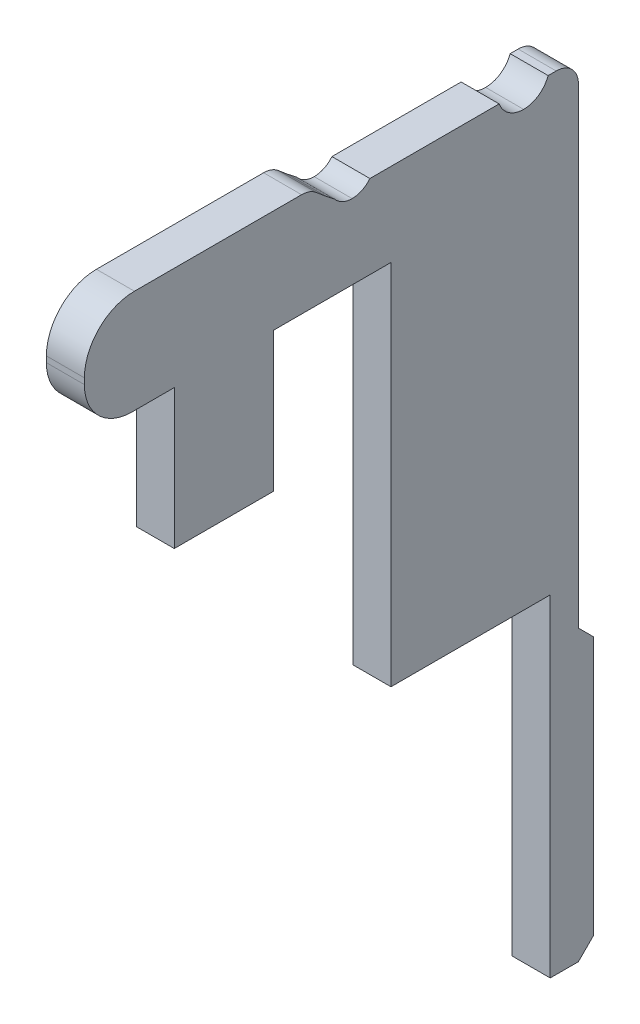
ISO-10303-21;
HEADER;
FILE_DESCRIPTION(('STEP AP214'),'2;1');
FILE_NAME('part.step','',(''),(''),'','','');
FILE_SCHEMA(('AUTOMOTIVE_DESIGN { 1 0 10303 214 1 1 1 1 }'));
ENDSEC;
DATA;
#1=APPLICATION_CONTEXT('core data for automotive mechanical design processes');
#2=APPLICATION_PROTOCOL_DEFINITION('international standard','automotive_design',2000,#1);
#3=PRODUCT_CONTEXT('',#1,'mechanical');
#4=PRODUCT('Part','Part','',(#3));
#5=PRODUCT_RELATED_PRODUCT_CATEGORY('part','',(#4));
#6=PRODUCT_DEFINITION_FORMATION('','',#4);
#7=PRODUCT_DEFINITION_CONTEXT('part definition',#1,'design');
#8=PRODUCT_DEFINITION('design','',#6,#7);
#9=PRODUCT_DEFINITION_SHAPE('','',#8);
#10=(LENGTH_UNIT() NAMED_UNIT(*) SI_UNIT(.MILLI.,.METRE.));
#11=(NAMED_UNIT(*) PLANE_ANGLE_UNIT() SI_UNIT($,.RADIAN.));
#12=(NAMED_UNIT(*) SI_UNIT($,.STERADIAN.) SOLID_ANGLE_UNIT());
#13=UNCERTAINTY_MEASURE_WITH_UNIT(LENGTH_MEASURE(1.E-05),#10,'distance_accuracy_value','');
#14=(GEOMETRIC_REPRESENTATION_CONTEXT(3) GLOBAL_UNCERTAINTY_ASSIGNED_CONTEXT((#13)) GLOBAL_UNIT_ASSIGNED_CONTEXT((#10,
#11,#12)) REPRESENTATION_CONTEXT('',''));
#15=CARTESIAN_POINT('',(0.,0.,0.));
#16=DIRECTION('',(0.,0.,1.));
#17=DIRECTION('',(1.,0.,0.));
#18=AXIS2_PLACEMENT_3D('',#15,#16,#17);
#19=CARTESIAN_POINT('',(3.791025966667,-11.01654617923,3.239858541256));
#20=DIRECTION('',(-1.,0.,0.));
#21=DIRECTION('',(0.,0.,1.));
#22=AXIS2_PLACEMENT_3D('',#19,#20,#21);
#23=PLANE('',#22);
#24=DIRECTION('',(0.,-1.,0.));
#25=VECTOR('',#24,1.);
#26=CARTESIAN_POINT('',(3.791025966667,-11.56808151461,1.690040249312));
#27=LINE('',#26,#25);
#28=CARTESIAN_POINT('',(3.791025966667,-11.56808151461,1.690040249312));
#29=VERTEX_POINT('',#28);
#30=CARTESIAN_POINT('',(3.791025966667,-12.92902195149,1.690040249312));
#31=VERTEX_POINT('',#30);
#32=EDGE_CURVE('E11',#29,#31,#27,.T.);
#33=ORIENTED_EDGE('',*,*,#32,.F.);
#34=DIRECTION('',(0.,0.707106781186548,0.707106781186548));
#35=VECTOR('',#34,1.);
#36=CARTESIAN_POINT('',(3.791025966667,-11.56808151461,1.690040249312));
#37=LINE('',#36,#35);
#38=CARTESIAN_POINT('',(3.791025966667,-11.48809089309,1.770030870831));
#39=VERTEX_POINT('',#38);
#40=EDGE_CURVE('E25',#29,#39,#37,.T.);
#41=ORIENTED_EDGE('',*,*,#40,.T.);
#42=DIRECTION('',(0.,-1.,0.));
#43=VECTOR('',#42,1.);
#44=CARTESIAN_POINT('',(3.791025966667,-9.007381743218,1.770030870831));
#45=LINE('',#44,#43);
#46=CARTESIAN_POINT('',(3.791025966667,-9.007381743218,1.770030870831));
#47=VERTEX_POINT('',#46);
#48=EDGE_CURVE('E470',#47,#39,#45,.T.);
#49=ORIENTED_EDGE('',*,*,#48,.F.);
#50=CARTESIAN_POINT('',(3.791025966667,-9.007381743218,1.887017154804));
#51=DIRECTION('',(-1.,0.,0.));
#52=DIRECTION('',(0.,1.,0.));
#53=AXIS2_PLACEMENT_3D('',#50,#51,#52);
#54=CIRCLE('',#53,0.116986283973);
#55=CARTESIAN_POINT('',(3.791025966667,-8.890395459246,1.887017154804));
#56=VERTEX_POINT('',#55);
#57=EDGE_CURVE('E465',#56,#47,#54,.T.);
#58=ORIENTED_EDGE('',*,*,#57,.F.);
#59=DIRECTION('',(0.,0.,-1.));
#60=VECTOR('',#59,1.);
#61=CARTESIAN_POINT('',(3.791025966667,-8.890395459246,1.929141929951));
#62=LINE('',#61,#60);
#63=CARTESIAN_POINT('',(3.791025966667,-8.890395459246,1.929141929951));
#64=VERTEX_POINT('',#63);
#65=EDGE_CURVE('E461',#64,#56,#62,.T.);
#66=ORIENTED_EDGE('',*,*,#65,.F.);
#67=CARTESIAN_POINT('',(3.791025966667,-8.842101121503,2.058184733088));
#68=DIRECTION('',(1.,0.,0.));
#69=DIRECTION('',(0.,-0.350507982583099,0.936559744034264));
#70=AXIS2_PLACEMENT_3D('',#67,#68,#69);
#71=CIRCLE('',#70,0.137783845568);
#72=CARTESIAN_POINT('',(3.791025966667,-8.979884967071,2.058184733088));
#73=VERTEX_POINT('',#72);
#74=EDGE_CURVE('E209',#73,#64,#71,.T.);
#75=ORIENTED_EDGE('',*,*,#74,.F.);
#76=CARTESIAN_POINT('',(3.791025966667,-8.842101121503,2.058184733088));
#77=DIRECTION('',(1.,0.,0.));
#78=DIRECTION('',(0.,-0.350507982583099,0.936559744034264));
#79=AXIS2_PLACEMENT_3D('',#76,#77,#78);
#80=CIRCLE('',#79,0.137783845568);
#81=CARTESIAN_POINT('',(3.791025966667,-8.890395459246,2.187227536225));
#82=VERTEX_POINT('',#81);
#83=EDGE_CURVE('E453',#82,#73,#80,.T.);
#84=ORIENTED_EDGE('',*,*,#83,.F.);
#85=DIRECTION('',(0.,0.,-1.));
#86=VECTOR('',#85,1.);
#87=CARTESIAN_POINT('',(3.791025966667,-8.890395459246,2.867347795696));
#88=LINE('',#87,#86);
#89=CARTESIAN_POINT('',(3.791025966667,-8.890395459246,2.867347795696));
#90=VERTEX_POINT('',#89);
#91=EDGE_CURVE('E448',#90,#82,#88,.T.);
#92=ORIENTED_EDGE('',*,*,#91,.F.);
#93=CARTESIAN_POINT('',(3.791025966667,-8.815690770428,2.960728820981));
#94=DIRECTION('',(1.,0.,0.));
#95=DIRECTION('',(0.,-0.624694377505048,0.78086934548206));
#96=AXIS2_PLACEMENT_3D('',#93,#94,#95);
#97=CIRCLE('',#96,0.119585979172);
#98=CARTESIAN_POINT('',(3.791025966667,-8.9352767496,2.960728820981));
#99=VERTEX_POINT('',#98);
#100=EDGE_CURVE('E443',#99,#90,#97,.T.);
#101=ORIENTED_EDGE('',*,*,#100,.F.);
#102=CARTESIAN_POINT('',(3.791025966667,-8.815690770428,2.960728820981));
#103=DIRECTION('',(1.,0.,0.));
#104=DIRECTION('',(0.,-0.624694377505048,0.78086934548206));
#105=AXIS2_PLACEMENT_3D('',#102,#103,#104);
#106=CIRCLE('',#105,0.119585979172);
#107=CARTESIAN_POINT('',(3.791025966667,-8.890395459246,3.054109846266));
#108=VERTEX_POINT('',#107);
#109=EDGE_CURVE('E438',#108,#99,#106,.T.);
#110=ORIENTED_EDGE('',*,*,#109,.F.);
#111=DIRECTION('',(0.,-0.614333401356799,-0.789046558814742));
#112=VECTOR('',#111,1.);
#113=CARTESIAN_POINT('',(3.791025966667,-8.855429561475,3.099019859706));
#114=LINE('',#113,#112);
#115=CARTESIAN_POINT('',(3.791025966667,-8.855429561475,3.099019859706));
#116=VERTEX_POINT('',#115);
#117=EDGE_CURVE('E433',#116,#108,#114,.T.);
#118=ORIENTED_EDGE('',*,*,#117,.F.);
#119=DIRECTION('',(0.,-0.645196367154793,-0.764016785031755));
#120=VECTOR('',#119,1.);
#121=CARTESIAN_POINT('',(3.791025966667,-8.812628169562,3.149703625935));
#122=LINE('',#121,#120);
#123=CARTESIAN_POINT('',(3.791025966667,-8.812628169562,3.149703625935));
#124=VERTEX_POINT('',#123);
#125=EDGE_CURVE('E428',#124,#116,#122,.T.);
#126=ORIENTED_EDGE('',*,*,#125,.F.);
#127=CARTESIAN_POINT('',(3.791025966667,-8.903993864904,3.226860065259));
#128=DIRECTION('',(-1.,0.,0.));
#129=DIRECTION('',(0.,1.,0.));
#130=AXIS2_PLACEMENT_3D('',#127,#128,#129);
#131=CIRCLE('',#130,0.119585979172);
#132=CARTESIAN_POINT('',(3.791025966667,-8.784407885732,3.226860065259));
#133=VERTEX_POINT('',#132);
#134=EDGE_CURVE('E423',#133,#124,#131,.T.);
#135=ORIENTED_EDGE('',*,*,#134,.F.);
#136=DIRECTION('',(0.,0.,-1.));
#137=VECTOR('',#136,1.);
#138=CARTESIAN_POINT('',(3.791025966667,-8.784407885732,4.106656913699));
#139=LINE('',#138,#137);
#140=CARTESIAN_POINT('',(3.791025966667,-8.784407885732,4.106656913699));
#141=VERTEX_POINT('',#140);
#142=EDGE_CURVE('E418',#141,#133,#139,.T.);
#143=ORIENTED_EDGE('',*,*,#142,.F.);
#144=CARTESIAN_POINT('',(3.791025966667,-9.047677018809,4.106656913699));
#145=DIRECTION('',(-1.,0.,0.));
#146=DIRECTION('',(0.,0.,1.));
#147=AXIS2_PLACEMENT_3D('',#144,#145,#146);
#148=CIRCLE('',#147,0.263269133077);
#149=CARTESIAN_POINT('',(3.791025966667,-9.047677018809,4.369926046776));
#150=VERTEX_POINT('',#149);
#151=EDGE_CURVE('E413',#150,#141,#148,.T.);
#152=ORIENTED_EDGE('',*,*,#151,.F.);
#153=DIRECTION('',(0.,1.,0.));
#154=VECTOR('',#153,1.);
#155=CARTESIAN_POINT('',(3.791025966667,-9.078573396371,4.369926046776));
#156=LINE('',#155,#154);
#157=CARTESIAN_POINT('',(3.791025966667,-9.078573396371,4.369926046776));
#158=VERTEX_POINT('',#157);
#159=EDGE_CURVE('E408',#158,#150,#156,.T.);
#160=ORIENTED_EDGE('',*,*,#159,.F.);
#161=CARTESIAN_POINT('',(3.791025966667,-9.078573396371,4.119955354526));
#162=DIRECTION('',(-1.,0.,0.));
#163=DIRECTION('',(0.,-1.,0.));
#164=AXIS2_PLACEMENT_3D('',#161,#162,#163);
#165=CIRCLE('',#164,0.249970692249);
#166=CARTESIAN_POINT('',(3.791025966667,-9.32854408862,4.119955354526));
#167=VERTEX_POINT('',#166);
#168=EDGE_CURVE('E403',#167,#158,#165,.T.);
#169=ORIENTED_EDGE('',*,*,#168,.F.);
#170=DIRECTION('',(0.,0.,1.));
#171=VECTOR('',#170,1.);
#172=CARTESIAN_POINT('',(3.791025966667,-9.32854408862,3.896881508763));
#173=LINE('',#172,#171);
#174=CARTESIAN_POINT('',(3.791025966667,-9.32854408862,3.896881508763));
#175=VERTEX_POINT('',#174);
#176=EDGE_CURVE('E398',#175,#167,#173,.T.);
#177=ORIENTED_EDGE('',*,*,#176,.F.);
#178=DIRECTION('',(0.,1.,0.));
#179=VECTOR('',#178,1.);
#180=CARTESIAN_POINT('',(3.791025966667,-10.06235805278,3.896881508763));
#181=LINE('',#180,#179);
#182=CARTESIAN_POINT('',(3.791025966667,-10.06235805278,3.896881508763));
#183=VERTEX_POINT('',#182);
#184=EDGE_CURVE('E393',#183,#175,#181,.T.);
#185=ORIENTED_EDGE('',*,*,#184,.F.);
#186=DIRECTION('',(0.,0.,1.));
#187=VECTOR('',#186,1.);
#188=CARTESIAN_POINT('',(3.791025966667,-10.06235805278,3.375242668178));
#189=LINE('',#188,#187);
#190=CARTESIAN_POINT('',(3.791025966667,-10.06235805278,3.375242668178));
#191=VERTEX_POINT('',#190);
#192=EDGE_CURVE('E388',#191,#183,#189,.T.);
#193=ORIENTED_EDGE('',*,*,#192,.F.);
#194=DIRECTION('',(0.,-1.,0.));
#195=VECTOR('',#194,1.);
#196=CARTESIAN_POINT('',(3.791025966667,-9.32854408862,3.375242668178));
#197=LINE('',#196,#195);
#198=CARTESIAN_POINT('',(3.791025966667,-9.32854408862,3.375242668178));
#199=VERTEX_POINT('',#198);
#200=EDGE_CURVE('E383',#199,#191,#197,.T.);
#201=ORIENTED_EDGE('',*,*,#200,.F.);
#202=DIRECTION('',(0.,0.,1.));
#203=VECTOR('',#202,1.);
#204=CARTESIAN_POINT('',(3.791025966667,-9.32854408862,2.756415222446));
#205=LINE('',#204,#203);
#206=CARTESIAN_POINT('',(3.791025966667,-9.32854408862,2.756415222446));
#207=VERTEX_POINT('',#206);
#208=EDGE_CURVE('E378',#207,#199,#205,.T.);
#209=ORIENTED_EDGE('',*,*,#208,.F.);
#210=DIRECTION('',(0.,1.,0.));
#211=VECTOR('',#210,1.);
#212=CARTESIAN_POINT('',(3.791025966667,-11.26271731696,2.756415222446));
#213=LINE('',#212,#211);
#214=CARTESIAN_POINT('',(3.791025966667,-11.26271731696,2.756415222446));
#215=VERTEX_POINT('',#214);
#216=EDGE_CURVE('E373',#215,#207,#213,.T.);
#217=ORIENTED_EDGE('',*,*,#216,.F.);
#218=DIRECTION('',(0.,0.,1.));
#219=VECTOR('',#218,1.);
#220=CARTESIAN_POINT('',(3.791025966667,-11.26271731696,1.918313485474));
#221=LINE('',#220,#219);
#222=CARTESIAN_POINT('',(3.791025966667,-11.26271731696,1.918313485474));
#223=VERTEX_POINT('',#222);
#224=EDGE_CURVE('E368',#223,#215,#221,.T.);
#225=ORIENTED_EDGE('',*,*,#224,.F.);
#226=DIRECTION('',(0.,1.,0.));
#227=VECTOR('',#226,1.);
#228=CARTESIAN_POINT('',(3.791025966667,-13.00901257301,1.918313485474));
#229=LINE('',#228,#227);
#230=CARTESIAN_POINT('',(3.791025966667,-13.00901257301,1.918313485474));
#231=VERTEX_POINT('',#230);
#232=EDGE_CURVE('E363',#231,#223,#229,.T.);
#233=ORIENTED_EDGE('',*,*,#232,.F.);
#234=DIRECTION('',(0.,0.,1.));
#235=VECTOR('',#234,1.);
#236=CARTESIAN_POINT('',(3.791025966667,-13.00901257301,1.770030870831));
#237=LINE('',#236,#235);
#238=CARTESIAN_POINT('',(3.791025966667,-13.00901257301,1.770030870831));
#239=VERTEX_POINT('',#238);
#240=EDGE_CURVE('E358',#239,#231,#237,.T.);
#241=ORIENTED_EDGE('',*,*,#240,.F.);
#242=DIRECTION('',(0.,0.707106781186548,-0.707106781186548));
#243=VECTOR('',#242,1.);
#244=CARTESIAN_POINT('',(3.791025966667,-13.00901257301,1.770030870831));
#245=LINE('',#244,#243);
#246=EDGE_CURVE('E354',#239,#31,#245,.T.);
#247=ORIENTED_EDGE('',*,*,#246,.T.);
#248=EDGE_LOOP('',(#33,#41,#49,#58,#66,#75,#84,#92,#101,#110,#118,#126,#135,#143,#152,#160,#169,
#177,#185,#193,#201,#209,#217,#225,#233,#241,#247));
#249=FACE_BOUND('',#248,.T.);
#250=ADVANCED_FACE('F17',(#249),#23,.F.);
#251=CARTESIAN_POINT('',(3.691037689767,-12.96901726225,1.730035560072));
#252=DIRECTION('',(0.,-0.707106781186548,-0.707106781186548));
#253=DIRECTION('',(0.,-0.707106781186548,0.707106781186548));
#254=AXIS2_PLACEMENT_3D('',#251,#252,#253);
#255=PLANE('',#254);
#256=DIRECTION('',(1.,0.,0.));
#257=VECTOR('',#256,1.);
#258=CARTESIAN_POINT('',(3.591049412868,-13.00901257301,1.770030870831));
#259=LINE('',#258,#257);
#260=CARTESIAN_POINT('',(3.591049412868,-13.00901257301,1.770030870831));
#261=VERTEX_POINT('',#260);
#262=EDGE_CURVE('E349',#261,#239,#259,.T.);
#263=ORIENTED_EDGE('',*,*,#262,.F.);
#264=DIRECTION('',(0.,-0.707106781186548,0.707106781186548));
#265=VECTOR('',#264,1.);
#266=CARTESIAN_POINT('',(3.591049412868,-12.92902195149,1.690040249312));
#267=LINE('',#266,#265);
#268=CARTESIAN_POINT('',(3.591049412868,-12.92902195149,1.690040249312));
#269=VERTEX_POINT('',#268);
#270=EDGE_CURVE('E344',#269,#261,#267,.T.);
#271=ORIENTED_EDGE('',*,*,#270,.F.);
#272=DIRECTION('',(1.,0.,0.));
#273=VECTOR('',#272,1.);
#274=CARTESIAN_POINT('',(3.591049412868,-12.92902195149,1.690040249312));
#275=LINE('',#274,#273);
#276=EDGE_CURVE('E339',#269,#31,#275,.T.);
#277=ORIENTED_EDGE('',*,*,#276,.T.);
#278=ORIENTED_EDGE('',*,*,#246,.F.);
#279=EDGE_LOOP('',(#263,#271,#277,#278));
#280=FACE_BOUND('',#279,.T.);
#281=ADVANCED_FACE('F491',(#280),#255,.T.);
#282=CARTESIAN_POINT('',(3.591049412868,-11.56808151461,1.690040249312));
#283=DIRECTION('',(0.,0.,1.));
#284=DIRECTION('',(1.,0.,0.));
#285=AXIS2_PLACEMENT_3D('',#282,#283,#284);
#286=PLANE('',#285);
#287=DIRECTION('',(0.,-1.,0.));
#288=VECTOR('',#287,1.);
#289=CARTESIAN_POINT('',(3.591049412868,-11.56808151461,1.690040249312));
#290=LINE('',#289,#288);
#291=CARTESIAN_POINT('',(3.591049412868,-11.56808151461,1.690040249312));
#292=VERTEX_POINT('',#291);
#293=EDGE_CURVE('E334',#292,#269,#290,.T.);
#294=ORIENTED_EDGE('',*,*,#293,.F.);
#295=DIRECTION('',(-1.,0.,0.));
#296=VECTOR('',#295,1.);
#297=CARTESIAN_POINT('',(3.791025966667,-11.56808151461,1.690040249312));
#298=LINE('',#297,#296);
#299=EDGE_CURVE('E329',#29,#292,#298,.T.);
#300=ORIENTED_EDGE('',*,*,#299,.F.);
#301=ORIENTED_EDGE('',*,*,#32,.T.);
#302=ORIENTED_EDGE('',*,*,#276,.F.);
#303=EDGE_LOOP('',(#294,#300,#301,#302));
#304=FACE_BOUND('',#303,.T.);
#305=ADVANCED_FACE('F488',(#304),#286,.F.);
#306=CARTESIAN_POINT('',(3.691037689767,-11.52808620385,1.730035560072));
#307=DIRECTION('',(0.,0.707106781186548,-0.707106781186548));
#308=DIRECTION('',(-1.,0.,0.));
#309=AXIS2_PLACEMENT_3D('',#306,#307,#308);
#310=PLANE('',#309);
#311=DIRECTION('',(0.,-0.707106781186548,-0.707106781186548));
#312=VECTOR('',#311,1.);
#313=CARTESIAN_POINT('',(3.591049412868,-11.48809089309,1.770030870831));
#314=LINE('',#313,#312);
#315=CARTESIAN_POINT('',(3.591049412868,-11.48809089309,1.770030870831));
#316=VERTEX_POINT('',#315);
#317=EDGE_CURVE('E324',#316,#292,#314,.T.);
#318=ORIENTED_EDGE('',*,*,#317,.F.);
#319=DIRECTION('',(-1.,0.,0.));
#320=VECTOR('',#319,1.);
#321=CARTESIAN_POINT('',(3.791025966667,-11.48809089309,1.770030870831));
#322=LINE('',#321,#320);
#323=EDGE_CURVE('E319',#39,#316,#322,.T.);
#324=ORIENTED_EDGE('',*,*,#323,.F.);
#325=ORIENTED_EDGE('',*,*,#40,.F.);
#326=ORIENTED_EDGE('',*,*,#299,.T.);
#327=EDGE_LOOP('',(#318,#324,#325,#326));
#328=FACE_BOUND('',#327,.T.);
#329=ADVANCED_FACE('F486',(#328),#310,.T.);
#330=CARTESIAN_POINT('',(3.591049412868,-9.007381743218,1.770030870831));
#331=DIRECTION('',(0.,0.,1.));
#332=DIRECTION('',(1.,0.,0.));
#333=AXIS2_PLACEMENT_3D('',#330,#331,#332);
#334=PLANE('',#333);
#335=DIRECTION('',(0.,-1.,0.));
#336=VECTOR('',#335,1.);
#337=CARTESIAN_POINT('',(3.591049412868,-9.007381743218,1.770030870831));
#338=LINE('',#337,#336);
#339=CARTESIAN_POINT('',(3.591049412868,-9.007381743218,1.770030870831));
#340=VERTEX_POINT('',#339);
#341=EDGE_CURVE('E314',#340,#316,#338,.T.);
#342=ORIENTED_EDGE('',*,*,#341,.F.);
#343=DIRECTION('',(1.,0.,0.));
#344=VECTOR('',#343,1.);
#345=CARTESIAN_POINT('',(3.591049412868,-9.007381743218,1.770030870831));
#346=LINE('',#345,#344);
#347=EDGE_CURVE('E309',#340,#47,#346,.T.);
#348=ORIENTED_EDGE('',*,*,#347,.T.);
#349=ORIENTED_EDGE('',*,*,#48,.T.);
#350=ORIENTED_EDGE('',*,*,#323,.T.);
#351=EDGE_LOOP('',(#342,#348,#349,#350));
#352=FACE_BOUND('',#351,.T.);
#353=ADVANCED_FACE('F480',(#352),#334,.F.);
#354=CARTESIAN_POINT('',(3.591049412868,-9.007381743218,1.887017154804));
#355=DIRECTION('',(-1.,0.,0.));
#356=DIRECTION('',(0.,-0.707106781186549,0.707106781186546));
#357=AXIS2_PLACEMENT_3D('',#354,#355,#356);
#358=CYLINDRICAL_SURFACE('',#357,0.116986283973);
#359=DIRECTION('',(1.,0.,0.));
#360=VECTOR('',#359,1.);
#361=CARTESIAN_POINT('',(3.591049412868,-8.890395459246,1.887017154804));
#362=LINE('',#361,#360);
#363=CARTESIAN_POINT('',(3.591049412868,-8.890395459246,1.887017154804));
#364=VERTEX_POINT('',#363);
#365=EDGE_CURVE('E216',#364,#56,#362,.T.);
#366=ORIENTED_EDGE('',*,*,#365,.T.);
#367=ORIENTED_EDGE('',*,*,#57,.T.);
#368=ORIENTED_EDGE('',*,*,#347,.F.);
#369=CARTESIAN_POINT('',(3.591049412868,-9.007381743218,1.887017154804));
#370=DIRECTION('',(-1.,0.,0.));
#371=DIRECTION('',(0.,1.,0.));
#372=AXIS2_PLACEMENT_3D('',#369,#370,#371);
#373=CIRCLE('',#372,0.116986283973);
#374=EDGE_CURVE('E302',#364,#340,#373,.T.);
#375=ORIENTED_EDGE('',*,*,#374,.F.);
#376=EDGE_LOOP('',(#366,#367,#368,#375));
#377=FACE_BOUND('',#376,.T.);
#378=ADVANCED_FACE('F483',(#377),#358,.T.);
#379=CARTESIAN_POINT('',(3.591049412868,-11.01654617923,3.239858541256));
#380=DIRECTION('',(-1.,0.,0.));
#381=DIRECTION('',(0.,0.,1.));
#382=AXIS2_PLACEMENT_3D('',#379,#380,#381);
#383=PLANE('',#382);
#384=DIRECTION('',(0.,0.,1.));
#385=VECTOR('',#384,1.);
#386=CARTESIAN_POINT('',(3.591049412868,-13.00901257301,1.770030870831));
#387=LINE('',#386,#385);
#388=CARTESIAN_POINT('',(3.591049412868,-13.00901257301,1.918313485474));
#389=VERTEX_POINT('',#388);
#390=EDGE_CURVE('E298',#261,#389,#387,.T.);
#391=ORIENTED_EDGE('',*,*,#390,.T.);
#392=DIRECTION('',(0.,1.,0.));
#393=VECTOR('',#392,1.);
#394=CARTESIAN_POINT('',(3.591049412868,-13.00901257301,1.918313485474));
#395=LINE('',#394,#393);
#396=CARTESIAN_POINT('',(3.591049412868,-11.26271731696,1.918313485474));
#397=VERTEX_POINT('',#396);
#398=EDGE_CURVE('E294',#389,#397,#395,.T.);
#399=ORIENTED_EDGE('',*,*,#398,.T.);
#400=DIRECTION('',(0.,0.,1.));
#401=VECTOR('',#400,1.);
#402=CARTESIAN_POINT('',(3.591049412868,-11.26271731696,1.918313485474));
#403=LINE('',#402,#401);
#404=CARTESIAN_POINT('',(3.591049412868,-11.26271731696,2.756415222446));
#405=VERTEX_POINT('',#404);
#406=EDGE_CURVE('E290',#397,#405,#403,.T.);
#407=ORIENTED_EDGE('',*,*,#406,.T.);
#408=DIRECTION('',(0.,1.,0.));
#409=VECTOR('',#408,1.);
#410=CARTESIAN_POINT('',(3.591049412868,-11.26271731696,2.756415222446));
#411=LINE('',#410,#409);
#412=CARTESIAN_POINT('',(3.591049412868,-9.32854408862,2.756415222446));
#413=VERTEX_POINT('',#412);
#414=EDGE_CURVE('E286',#405,#413,#411,.T.);
#415=ORIENTED_EDGE('',*,*,#414,.T.);
#416=DIRECTION('',(0.,0.,1.));
#417=VECTOR('',#416,1.);
#418=CARTESIAN_POINT('',(3.591049412868,-9.32854408862,2.756415222446));
#419=LINE('',#418,#417);
#420=CARTESIAN_POINT('',(3.591049412868,-9.32854408862,3.375242668178));
#421=VERTEX_POINT('',#420);
#422=EDGE_CURVE('E282',#413,#421,#419,.T.);
#423=ORIENTED_EDGE('',*,*,#422,.T.);
#424=DIRECTION('',(0.,-1.,0.));
#425=VECTOR('',#424,1.);
#426=CARTESIAN_POINT('',(3.591049412868,-9.32854408862,3.375242668178));
#427=LINE('',#426,#425);
#428=CARTESIAN_POINT('',(3.591049412868,-10.06235805278,3.375242668178));
#429=VERTEX_POINT('',#428);
#430=EDGE_CURVE('E278',#421,#429,#427,.T.);
#431=ORIENTED_EDGE('',*,*,#430,.T.);
#432=DIRECTION('',(0.,0.,1.));
#433=VECTOR('',#432,1.);
#434=CARTESIAN_POINT('',(3.591049412868,-10.06235805278,3.375242668178));
#435=LINE('',#434,#433);
#436=CARTESIAN_POINT('',(3.591049412868,-10.06235805278,3.896881508763));
#437=VERTEX_POINT('',#436);
#438=EDGE_CURVE('E274',#429,#437,#435,.T.);
#439=ORIENTED_EDGE('',*,*,#438,.T.);
#440=DIRECTION('',(0.,1.,0.));
#441=VECTOR('',#440,1.);
#442=CARTESIAN_POINT('',(3.591049412868,-10.06235805278,3.896881508763));
#443=LINE('',#442,#441);
#444=CARTESIAN_POINT('',(3.591049412868,-9.32854408862,3.896881508763));
#445=VERTEX_POINT('',#444);
#446=EDGE_CURVE('E270',#437,#445,#443,.T.);
#447=ORIENTED_EDGE('',*,*,#446,.T.);
#448=DIRECTION('',(0.,0.,1.));
#449=VECTOR('',#448,1.);
#450=CARTESIAN_POINT('',(3.591049412868,-9.32854408862,3.896881508763));
#451=LINE('',#450,#449);
#452=CARTESIAN_POINT('',(3.591049412868,-9.32854408862,4.119955354526));
#453=VERTEX_POINT('',#452);
#454=EDGE_CURVE('E266',#445,#453,#451,.T.);
#455=ORIENTED_EDGE('',*,*,#454,.T.);
#456=CARTESIAN_POINT('',(3.591049412868,-9.078573396371,4.119955354526));
#457=DIRECTION('',(-1.,0.,0.));
#458=DIRECTION('',(0.,-1.,0.));
#459=AXIS2_PLACEMENT_3D('',#456,#457,#458);
#460=CIRCLE('',#459,0.249970692249);
#461=CARTESIAN_POINT('',(3.591049412868,-9.078573396371,4.369926046776));
#462=VERTEX_POINT('',#461);
#463=EDGE_CURVE('E262',#453,#462,#460,.T.);
#464=ORIENTED_EDGE('',*,*,#463,.T.);
#465=DIRECTION('',(0.,1.,0.));
#466=VECTOR('',#465,1.);
#467=CARTESIAN_POINT('',(3.591049412868,-9.078573396371,4.369926046776));
#468=LINE('',#467,#466);
#469=CARTESIAN_POINT('',(3.591049412868,-9.047677018809,4.369926046776));
#470=VERTEX_POINT('',#469);
#471=EDGE_CURVE('E258',#462,#470,#468,.T.);
#472=ORIENTED_EDGE('',*,*,#471,.T.);
#473=CARTESIAN_POINT('',(3.591049412868,-9.047677018809,4.106656913699));
#474=DIRECTION('',(-1.,0.,0.));
#475=DIRECTION('',(0.,0.,1.));
#476=AXIS2_PLACEMENT_3D('',#473,#474,#475);
#477=CIRCLE('',#476,0.263269133077);
#478=CARTESIAN_POINT('',(3.591049412868,-8.784407885732,4.106656913699));
#479=VERTEX_POINT('',#478);
#480=EDGE_CURVE('E254',#470,#479,#477,.T.);
#481=ORIENTED_EDGE('',*,*,#480,.T.);
#482=DIRECTION('',(0.,0.,-1.));
#483=VECTOR('',#482,1.);
#484=CARTESIAN_POINT('',(3.591049412868,-8.784407885732,4.106656913699));
#485=LINE('',#484,#483);
#486=CARTESIAN_POINT('',(3.591049412868,-8.784407885732,3.226860065259));
#487=VERTEX_POINT('',#486);
#488=EDGE_CURVE('E250',#479,#487,#485,.T.);
#489=ORIENTED_EDGE('',*,*,#488,.T.);
#490=CARTESIAN_POINT('',(3.591049412868,-8.903993864904,3.226860065259));
#491=DIRECTION('',(-1.,0.,0.));
#492=DIRECTION('',(0.,1.,0.));
#493=AXIS2_PLACEMENT_3D('',#490,#491,#492);
#494=CIRCLE('',#493,0.119585979172);
#495=CARTESIAN_POINT('',(3.591049412868,-8.812628169562,3.149703625935));
#496=VERTEX_POINT('',#495);
#497=EDGE_CURVE('E246',#487,#496,#494,.T.);
#498=ORIENTED_EDGE('',*,*,#497,.T.);
#499=DIRECTION('',(0.,-0.645196367154793,-0.764016785031755));
#500=VECTOR('',#499,1.);
#501=CARTESIAN_POINT('',(3.591049412868,-8.812628169562,3.149703625935));
#502=LINE('',#501,#500);
#503=CARTESIAN_POINT('',(3.591049412868,-8.855429561475,3.099019859706));
#504=VERTEX_POINT('',#503);
#505=EDGE_CURVE('E242',#496,#504,#502,.T.);
#506=ORIENTED_EDGE('',*,*,#505,.T.);
#507=DIRECTION('',(0.,-0.614333401356799,-0.789046558814742));
#508=VECTOR('',#507,1.);
#509=CARTESIAN_POINT('',(3.591049412868,-8.855429561475,3.099019859706));
#510=LINE('',#509,#508);
#511=CARTESIAN_POINT('',(3.591049412868,-8.890395459246,3.054109846266));
#512=VERTEX_POINT('',#511);
#513=EDGE_CURVE('E238',#504,#512,#510,.T.);
#514=ORIENTED_EDGE('',*,*,#513,.T.);
#515=CARTESIAN_POINT('',(3.591049412868,-8.815690770428,2.960728820981));
#516=DIRECTION('',(1.,0.,0.));
#517=DIRECTION('',(0.,-0.624694377505048,0.78086934548206));
#518=AXIS2_PLACEMENT_3D('',#515,#516,#517);
#519=CIRCLE('',#518,0.119585979172);
#520=CARTESIAN_POINT('',(3.591049412868,-8.9352767496,2.960728820981));
#521=VERTEX_POINT('',#520);
#522=EDGE_CURVE('E234',#512,#521,#519,.T.);
#523=ORIENTED_EDGE('',*,*,#522,.T.);
#524=CARTESIAN_POINT('',(3.591049412868,-8.815690770428,2.960728820981));
#525=DIRECTION('',(1.,0.,0.));
#526=DIRECTION('',(0.,-0.624694377505048,0.78086934548206));
#527=AXIS2_PLACEMENT_3D('',#524,#525,#526);
#528=CIRCLE('',#527,0.119585979172);
#529=CARTESIAN_POINT('',(3.591049412868,-8.890395459246,2.867347795696));
#530=VERTEX_POINT('',#529);
#531=EDGE_CURVE('E230',#521,#530,#528,.T.);
#532=ORIENTED_EDGE('',*,*,#531,.T.);
#533=DIRECTION('',(0.,0.,-1.));
#534=VECTOR('',#533,1.);
#535=CARTESIAN_POINT('',(3.591049412868,-8.890395459246,2.867347795696));
#536=LINE('',#535,#534);
#537=CARTESIAN_POINT('',(3.591049412868,-8.890395459246,2.187227536225));
#538=VERTEX_POINT('',#537);
#539=EDGE_CURVE('E226',#530,#538,#536,.T.);
#540=ORIENTED_EDGE('',*,*,#539,.T.);
#541=CARTESIAN_POINT('',(3.591049412868,-8.842101121503,2.058184733088));
#542=DIRECTION('',(1.,0.,0.));
#543=DIRECTION('',(0.,-0.350507982583099,0.936559744034264));
#544=AXIS2_PLACEMENT_3D('',#541,#542,#543);
#545=CIRCLE('',#544,0.137783845568);
#546=CARTESIAN_POINT('',(3.591049412868,-8.979884967071,2.058184733088));
#547=VERTEX_POINT('',#546);
#548=EDGE_CURVE('E200',#538,#547,#545,.T.);
#549=ORIENTED_EDGE('',*,*,#548,.T.);
#550=CARTESIAN_POINT('',(3.591049412868,-8.842101121503,2.058184733088));
#551=DIRECTION('',(1.,0.,0.));
#552=DIRECTION('',(0.,-0.350507982583099,0.936559744034264));
#553=AXIS2_PLACEMENT_3D('',#550,#551,#552);
#554=CIRCLE('',#553,0.137783845568);
#555=CARTESIAN_POINT('',(3.591049412868,-8.890395459246,1.929141929951));
#556=VERTEX_POINT('',#555);
#557=EDGE_CURVE('E192',#547,#556,#554,.T.);
#558=ORIENTED_EDGE('',*,*,#557,.T.);
#559=DIRECTION('',(0.,0.,-1.));
#560=VECTOR('',#559,1.);
#561=CARTESIAN_POINT('',(3.591049412868,-8.890395459246,1.929141929951));
#562=LINE('',#561,#560);
#563=EDGE_CURVE('E197',#556,#364,#562,.T.);
#564=ORIENTED_EDGE('',*,*,#563,.T.);
#565=ORIENTED_EDGE('',*,*,#374,.T.);
#566=ORIENTED_EDGE('',*,*,#341,.T.);
#567=ORIENTED_EDGE('',*,*,#317,.T.);
#568=ORIENTED_EDGE('',*,*,#293,.T.);
#569=ORIENTED_EDGE('',*,*,#270,.T.);
#570=EDGE_LOOP('',(#391,#399,#407,#415,#423,#431,#439,#447,#455,#464,#472,#481,#489,#498,#506,
#514,#523,#532,#540,#549,#558,#564,#565,#566,#567,#568,#569));
#571=FACE_BOUND('',#570,.T.);
#572=ADVANCED_FACE('F194',(#571),#383,.T.);
#573=CARTESIAN_POINT('',(3.591049412868,-8.890395459246,1.929141929951));
#574=DIRECTION('',(0.,-1.,0.));
#575=DIRECTION('',(0.,0.,-1.));
#576=AXIS2_PLACEMENT_3D('',#573,#574,#575);
#577=PLANE('',#576);
#578=DIRECTION('',(1.,0.,0.));
#579=VECTOR('',#578,1.);
#580=CARTESIAN_POINT('',(3.591049412868,-8.890395459246,1.929141929951));
#581=LINE('',#580,#579);
#582=EDGE_CURVE('E207',#556,#64,#581,.T.);
#583=ORIENTED_EDGE('',*,*,#582,.T.);
#584=ORIENTED_EDGE('',*,*,#65,.T.);
#585=ORIENTED_EDGE('',*,*,#365,.F.);
#586=ORIENTED_EDGE('',*,*,#563,.F.);
#587=EDGE_LOOP('',(#583,#584,#585,#586));
#588=FACE_BOUND('',#587,.T.);
#589=ADVANCED_FACE('F214',(#588),#577,.F.);
#590=CARTESIAN_POINT('',(3.591049412868,-8.842101121503,2.058184733088));
#591=DIRECTION('',(-1.,0.,0.));
#592=DIRECTION('',(0.,0.821738393124891,0.569864907907586));
#593=AXIS2_PLACEMENT_3D('',#590,#591,#592);
#594=CYLINDRICAL_SURFACE('',#593,0.137783845568);
#595=DIRECTION('',(-1.,0.,0.));
#596=VECTOR('',#595,1.);
#597=CARTESIAN_POINT('',(3.691037689767,-8.979884967071,2.058184733088));
#598=LINE('',#597,#596);
#599=EDGE_CURVE('E212',#73,#547,#598,.T.);
#600=ORIENTED_EDGE('',*,*,#599,.F.);
#601=ORIENTED_EDGE('',*,*,#74,.T.);
#602=ORIENTED_EDGE('',*,*,#582,.F.);
#603=ORIENTED_EDGE('',*,*,#557,.F.);
#604=EDGE_LOOP('',(#600,#601,#602,#603));
#605=FACE_BOUND('',#604,.T.);
#606=ADVANCED_FACE('F208',(#605),#594,.F.);
#607=CARTESIAN_POINT('',(3.591049412868,-8.842101121503,2.058184733088));
#608=DIRECTION('',(-1.,0.,0.));
#609=DIRECTION('',(0.,0.821738400050759,-0.569864897920567));
#610=AXIS2_PLACEMENT_3D('',#607,#608,#609);
#611=CYLINDRICAL_SURFACE('',#610,0.137783845568);
#612=ORIENTED_EDGE('',*,*,#599,.T.);
#613=ORIENTED_EDGE('',*,*,#548,.F.);
#614=DIRECTION('',(1.,0.,0.));
#615=VECTOR('',#614,1.);
#616=CARTESIAN_POINT('',(3.591049412868,-8.890395459246,2.187227536225));
#617=LINE('',#616,#615);
#618=EDGE_CURVE('E591',#538,#82,#617,.T.);
#619=ORIENTED_EDGE('',*,*,#618,.T.);
#620=ORIENTED_EDGE('',*,*,#83,.T.);
#621=EDGE_LOOP('',(#612,#613,#619,#620));
#622=FACE_BOUND('',#621,.T.);
#623=ADVANCED_FACE('F601',(#622),#611,.F.);
#624=CARTESIAN_POINT('',(3.591049412868,-8.890395459246,2.867347795696));
#625=DIRECTION('',(0.,-1.,0.));
#626=DIRECTION('',(0.,0.,-1.));
#627=AXIS2_PLACEMENT_3D('',#624,#625,#626);
#628=PLANE('',#627);
#629=DIRECTION('',(1.,0.,0.));
#630=VECTOR('',#629,1.);
#631=CARTESIAN_POINT('',(3.591049412868,-8.890395459246,2.867347795696));
#632=LINE('',#631,#630);
#633=EDGE_CURVE('E586',#530,#90,#632,.T.);
#634=ORIENTED_EDGE('',*,*,#633,.T.);
#635=ORIENTED_EDGE('',*,*,#91,.T.);
#636=ORIENTED_EDGE('',*,*,#618,.F.);
#637=ORIENTED_EDGE('',*,*,#539,.F.);
#638=EDGE_LOOP('',(#634,#635,#636,#637));
#639=FACE_BOUND('',#638,.T.);
#640=ADVANCED_FACE('F607',(#639),#628,.F.);
#641=CARTESIAN_POINT('',(3.591049412868,-8.815690770428,2.960728820981));
#642=DIRECTION('',(-1.,0.,0.));
#643=DIRECTION('',(0.,0.901303050997574,0.433189116048019));
#644=AXIS2_PLACEMENT_3D('',#641,#642,#643);
#645=CYLINDRICAL_SURFACE('',#644,0.119585979172);
#646=DIRECTION('',(-1.,0.,0.));
#647=VECTOR('',#646,1.);
#648=CARTESIAN_POINT('',(3.691037689767,-8.9352767496,2.960728820981));
#649=LINE('',#648,#647);
#650=EDGE_CURVE('E581',#99,#521,#649,.T.);
#651=ORIENTED_EDGE('',*,*,#650,.F.);
#652=ORIENTED_EDGE('',*,*,#100,.T.);
#653=ORIENTED_EDGE('',*,*,#633,.F.);
#654=ORIENTED_EDGE('',*,*,#531,.F.);
#655=EDGE_LOOP('',(#651,#652,#653,#654));
#656=FACE_BOUND('',#655,.T.);
#657=ADVANCED_FACE('F610',(#656),#645,.F.);
#658=CARTESIAN_POINT('',(3.591049412868,-8.815690770428,2.960728820981));
#659=DIRECTION('',(-1.,0.,0.));
#660=DIRECTION('',(0.,0.901303050451135,-0.433189117184952));
#661=AXIS2_PLACEMENT_3D('',#658,#659,#660);
#662=CYLINDRICAL_SURFACE('',#661,0.119585979172);
#663=ORIENTED_EDGE('',*,*,#650,.T.);
#664=ORIENTED_EDGE('',*,*,#522,.F.);
#665=DIRECTION('',(1.,0.,0.));
#666=VECTOR('',#665,1.);
#667=CARTESIAN_POINT('',(3.591049412868,-8.890395459246,3.054109846266));
#668=LINE('',#667,#666);
#669=EDGE_CURVE('E576',#512,#108,#668,.T.);
#670=ORIENTED_EDGE('',*,*,#669,.T.);
#671=ORIENTED_EDGE('',*,*,#109,.T.);
#672=EDGE_LOOP('',(#663,#664,#670,#671));
#673=FACE_BOUND('',#672,.T.);
#674=ADVANCED_FACE('F613',(#673),#662,.F.);
#675=CARTESIAN_POINT('',(3.591049412868,-8.855429561475,3.099019859706));
#676=DIRECTION('',(0.,-0.789046558814742,0.614333401356799));
#677=DIRECTION('',(-1.,0.,0.));
#678=AXIS2_PLACEMENT_3D('',#675,#676,#677);
#679=PLANE('',#678);
#680=DIRECTION('',(1.,0.,0.));
#681=VECTOR('',#680,1.);
#682=CARTESIAN_POINT('',(3.591049412868,-8.855429561475,3.099019859706));
#683=LINE('',#682,#681);
#684=EDGE_CURVE('E571',#504,#116,#683,.T.);
#685=ORIENTED_EDGE('',*,*,#684,.T.);
#686=ORIENTED_EDGE('',*,*,#117,.T.);
#687=ORIENTED_EDGE('',*,*,#669,.F.);
#688=ORIENTED_EDGE('',*,*,#513,.F.);
#689=EDGE_LOOP('',(#685,#686,#687,#688));
#690=FACE_BOUND('',#689,.T.);
#691=ADVANCED_FACE('F618',(#690),#679,.F.);
#692=CARTESIAN_POINT('',(3.591049412868,-8.812628169562,3.149703625935));
#693=DIRECTION('',(0.,-0.764016785031755,0.645196367154793));
#694=DIRECTION('',(-1.,0.,0.));
#695=AXIS2_PLACEMENT_3D('',#692,#693,#694);
#696=PLANE('',#695);
#697=DIRECTION('',(1.,0.,0.));
#698=VECTOR('',#697,1.);
#699=CARTESIAN_POINT('',(3.591049412868,-8.812628169562,3.149703625935));
#700=LINE('',#699,#698);
#701=EDGE_CURVE('E566',#496,#124,#700,.T.);
#702=ORIENTED_EDGE('',*,*,#701,.T.);
#703=ORIENTED_EDGE('',*,*,#125,.T.);
#704=ORIENTED_EDGE('',*,*,#684,.F.);
#705=ORIENTED_EDGE('',*,*,#505,.F.);
#706=EDGE_LOOP('',(#702,#703,#704,#705));
#707=FACE_BOUND('',#706,.T.);
#708=ADVANCED_FACE('F621',(#707),#696,.F.);
#709=CARTESIAN_POINT('',(3.591049412868,-8.903993864904,3.226860065259));
#710=DIRECTION('',(-1.,0.,0.));
#711=DIRECTION('',(0.,-0.939153018691302,0.343499064748386));
#712=AXIS2_PLACEMENT_3D('',#709,#710,#711);
#713=CYLINDRICAL_SURFACE('',#712,0.119585979172);
#714=DIRECTION('',(1.,0.,0.));
#715=VECTOR('',#714,1.);
#716=CARTESIAN_POINT('',(3.591049412868,-8.784407885732,3.226860065259));
#717=LINE('',#716,#715);
#718=EDGE_CURVE('E561',#487,#133,#717,.T.);
#719=ORIENTED_EDGE('',*,*,#718,.T.);
#720=ORIENTED_EDGE('',*,*,#134,.T.);
#721=ORIENTED_EDGE('',*,*,#701,.F.);
#722=ORIENTED_EDGE('',*,*,#497,.F.);
#723=EDGE_LOOP('',(#719,#720,#721,#722));
#724=FACE_BOUND('',#723,.T.);
#725=ADVANCED_FACE('F625',(#724),#713,.T.);
#726=CARTESIAN_POINT('',(3.591049412868,-8.784407885732,4.106656913699));
#727=DIRECTION('',(0.,-1.,0.));
#728=DIRECTION('',(0.,0.,-1.));
#729=AXIS2_PLACEMENT_3D('',#726,#727,#728);
#730=PLANE('',#729);
#731=DIRECTION('',(1.,0.,0.));
#732=VECTOR('',#731,1.);
#733=CARTESIAN_POINT('',(3.591049412868,-8.784407885732,4.106656913699));
#734=LINE('',#733,#732);
#735=EDGE_CURVE('E556',#479,#141,#734,.T.);
#736=ORIENTED_EDGE('',*,*,#735,.T.);
#737=ORIENTED_EDGE('',*,*,#142,.T.);
#738=ORIENTED_EDGE('',*,*,#718,.F.);
#739=ORIENTED_EDGE('',*,*,#488,.F.);
#740=EDGE_LOOP('',(#736,#737,#738,#739));
#741=FACE_BOUND('',#740,.T.);
#742=ADVANCED_FACE('F630',(#741),#730,.F.);
#743=CARTESIAN_POINT('',(3.591049412868,-9.047677018809,4.106656913699));
#744=DIRECTION('',(-1.,0.,0.));
#745=DIRECTION('',(0.,-0.707106781186548,-0.707106781186548));
#746=AXIS2_PLACEMENT_3D('',#743,#744,#745);
#747=CYLINDRICAL_SURFACE('',#746,0.263269133077);
#748=DIRECTION('',(1.,0.,0.));
#749=VECTOR('',#748,1.);
#750=CARTESIAN_POINT('',(3.591049412868,-9.047677018809,4.369926046776));
#751=LINE('',#750,#749);
#752=EDGE_CURVE('E551',#470,#150,#751,.T.);
#753=ORIENTED_EDGE('',*,*,#752,.T.);
#754=ORIENTED_EDGE('',*,*,#151,.T.);
#755=ORIENTED_EDGE('',*,*,#735,.F.);
#756=ORIENTED_EDGE('',*,*,#480,.F.);
#757=EDGE_LOOP('',(#753,#754,#755,#756));
#758=FACE_BOUND('',#757,.T.);
#759=ADVANCED_FACE('F633',(#758),#747,.T.);
#760=CARTESIAN_POINT('',(3.591049412868,-9.078573396371,4.369926046776));
#761=DIRECTION('',(0.,0.,-1.));
#762=DIRECTION('',(0.,-1.,0.));
#763=AXIS2_PLACEMENT_3D('',#760,#761,#762);
#764=PLANE('',#763);
#765=DIRECTION('',(1.,0.,0.));
#766=VECTOR('',#765,1.);
#767=CARTESIAN_POINT('',(3.591049412868,-9.078573396371,4.369926046776));
#768=LINE('',#767,#766);
#769=EDGE_CURVE('E546',#462,#158,#768,.T.);
#770=ORIENTED_EDGE('',*,*,#769,.T.);
#771=ORIENTED_EDGE('',*,*,#159,.T.);
#772=ORIENTED_EDGE('',*,*,#752,.F.);
#773=ORIENTED_EDGE('',*,*,#471,.F.);
#774=EDGE_LOOP('',(#770,#771,#772,#773));
#775=FACE_BOUND('',#774,.T.);
#776=ADVANCED_FACE('F637',(#775),#764,.F.);
#777=CARTESIAN_POINT('',(3.591049412868,-9.078573396371,4.119955354526));
#778=DIRECTION('',(-1.,0.,0.));
#779=DIRECTION('',(0.,0.707106781186547,-0.707106781186548));
#780=AXIS2_PLACEMENT_3D('',#777,#778,#779);
#781=CYLINDRICAL_SURFACE('',#780,0.249970692249);
#782=DIRECTION('',(1.,0.,0.));
#783=VECTOR('',#782,1.);
#784=CARTESIAN_POINT('',(3.591049412868,-9.32854408862,4.119955354526));
#785=LINE('',#784,#783);
#786=EDGE_CURVE('E541',#453,#167,#785,.T.);
#787=ORIENTED_EDGE('',*,*,#786,.T.);
#788=ORIENTED_EDGE('',*,*,#168,.T.);
#789=ORIENTED_EDGE('',*,*,#769,.F.);
#790=ORIENTED_EDGE('',*,*,#463,.F.);
#791=EDGE_LOOP('',(#787,#788,#789,#790));
#792=FACE_BOUND('',#791,.T.);
#793=ADVANCED_FACE('F642',(#792),#781,.T.);
#794=CARTESIAN_POINT('',(3.591049412868,-9.32854408862,3.896881508763));
#795=DIRECTION('',(0.,1.,0.));
#796=DIRECTION('',(1.,0.,0.));
#797=AXIS2_PLACEMENT_3D('',#794,#795,#796);
#798=PLANE('',#797);
#799=DIRECTION('',(1.,0.,0.));
#800=VECTOR('',#799,1.);
#801=CARTESIAN_POINT('',(3.591049412868,-9.32854408862,3.896881508763));
#802=LINE('',#801,#800);
#803=EDGE_CURVE('E536',#445,#175,#802,.T.);
#804=ORIENTED_EDGE('',*,*,#803,.T.);
#805=ORIENTED_EDGE('',*,*,#176,.T.);
#806=ORIENTED_EDGE('',*,*,#786,.F.);
#807=ORIENTED_EDGE('',*,*,#454,.F.);
#808=EDGE_LOOP('',(#804,#805,#806,#807));
#809=FACE_BOUND('',#808,.T.);
#810=ADVANCED_FACE('F645',(#809),#798,.F.);
#811=CARTESIAN_POINT('',(3.591049412868,-10.06235805278,3.896881508763));
#812=DIRECTION('',(0.,0.,-1.));
#813=DIRECTION('',(0.,-1.,0.));
#814=AXIS2_PLACEMENT_3D('',#811,#812,#813);
#815=PLANE('',#814);
#816=DIRECTION('',(1.,0.,0.));
#817=VECTOR('',#816,1.);
#818=CARTESIAN_POINT('',(3.591049412868,-10.06235805278,3.896881508763));
#819=LINE('',#818,#817);
#820=EDGE_CURVE('E531',#437,#183,#819,.T.);
#821=ORIENTED_EDGE('',*,*,#820,.T.);
#822=ORIENTED_EDGE('',*,*,#184,.T.);
#823=ORIENTED_EDGE('',*,*,#803,.F.);
#824=ORIENTED_EDGE('',*,*,#446,.F.);
#825=EDGE_LOOP('',(#821,#822,#823,#824));
#826=FACE_BOUND('',#825,.T.);
#827=ADVANCED_FACE('F649',(#826),#815,.F.);
#828=CARTESIAN_POINT('',(3.591049412868,-10.06235805278,3.375242668178));
#829=DIRECTION('',(0.,1.,0.));
#830=DIRECTION('',(1.,0.,0.));
#831=AXIS2_PLACEMENT_3D('',#828,#829,#830);
#832=PLANE('',#831);
#833=DIRECTION('',(1.,0.,0.));
#834=VECTOR('',#833,1.);
#835=CARTESIAN_POINT('',(3.591049412868,-10.06235805278,3.375242668178));
#836=LINE('',#835,#834);
#837=EDGE_CURVE('E526',#429,#191,#836,.T.);
#838=ORIENTED_EDGE('',*,*,#837,.T.);
#839=ORIENTED_EDGE('',*,*,#192,.T.);
#840=ORIENTED_EDGE('',*,*,#820,.F.);
#841=ORIENTED_EDGE('',*,*,#438,.F.);
#842=EDGE_LOOP('',(#838,#839,#840,#841));
#843=FACE_BOUND('',#842,.T.);
#844=ADVANCED_FACE('F654',(#843),#832,.F.);
#845=CARTESIAN_POINT('',(3.591049412868,-9.32854408862,3.375242668178));
#846=DIRECTION('',(0.,0.,1.));
#847=DIRECTION('',(1.,0.,0.));
#848=AXIS2_PLACEMENT_3D('',#845,#846,#847);
#849=PLANE('',#848);
#850=DIRECTION('',(1.,0.,0.));
#851=VECTOR('',#850,1.);
#852=CARTESIAN_POINT('',(3.591049412868,-9.32854408862,3.375242668178));
#853=LINE('',#852,#851);
#854=EDGE_CURVE('E521',#421,#199,#853,.T.);
#855=ORIENTED_EDGE('',*,*,#854,.T.);
#856=ORIENTED_EDGE('',*,*,#200,.T.);
#857=ORIENTED_EDGE('',*,*,#837,.F.);
#858=ORIENTED_EDGE('',*,*,#430,.F.);
#859=EDGE_LOOP('',(#855,#856,#857,#858));
#860=FACE_BOUND('',#859,.T.);
#861=ADVANCED_FACE('F657',(#860),#849,.F.);
#862=CARTESIAN_POINT('',(3.591049412868,-9.32854408862,2.756415222446));
#863=DIRECTION('',(0.,1.,0.));
#864=DIRECTION('',(1.,0.,0.));
#865=AXIS2_PLACEMENT_3D('',#862,#863,#864);
#866=PLANE('',#865);
#867=DIRECTION('',(1.,0.,0.));
#868=VECTOR('',#867,1.);
#869=CARTESIAN_POINT('',(3.591049412868,-9.32854408862,2.756415222446));
#870=LINE('',#869,#868);
#871=EDGE_CURVE('E510',#413,#207,#870,.T.);
#872=ORIENTED_EDGE('',*,*,#871,.T.);
#873=ORIENTED_EDGE('',*,*,#208,.T.);
#874=ORIENTED_EDGE('',*,*,#854,.F.);
#875=ORIENTED_EDGE('',*,*,#422,.F.);
#876=EDGE_LOOP('',(#872,#873,#874,#875));
#877=FACE_BOUND('',#876,.T.);
#878=ADVANCED_FACE('F661',(#877),#866,.F.);
#879=CARTESIAN_POINT('',(3.591049412868,-11.26271731696,2.756415222446));
#880=DIRECTION('',(0.,0.,-1.));
#881=DIRECTION('',(0.,-1.,0.));
#882=AXIS2_PLACEMENT_3D('',#879,#880,#881);
#883=PLANE('',#882);
#884=DIRECTION('',(1.,0.,0.));
#885=VECTOR('',#884,1.);
#886=CARTESIAN_POINT('',(3.591049412868,-11.26271731696,2.756415222446));
#887=LINE('',#886,#885);
#888=EDGE_CURVE('E507',#405,#215,#887,.T.);
#889=ORIENTED_EDGE('',*,*,#888,.T.);
#890=ORIENTED_EDGE('',*,*,#216,.T.);
#891=ORIENTED_EDGE('',*,*,#871,.F.);
#892=ORIENTED_EDGE('',*,*,#414,.F.);
#893=EDGE_LOOP('',(#889,#890,#891,#892));
#894=FACE_BOUND('',#893,.T.);
#895=ADVANCED_FACE('F666',(#894),#883,.F.);
#896=CARTESIAN_POINT('',(3.591049412868,-11.26271731696,1.918313485474));
#897=DIRECTION('',(0.,1.,0.));
#898=DIRECTION('',(1.,0.,0.));
#899=AXIS2_PLACEMENT_3D('',#896,#897,#898);
#900=PLANE('',#899);
#901=DIRECTION('',(1.,0.,0.));
#902=VECTOR('',#901,1.);
#903=CARTESIAN_POINT('',(3.591049412868,-11.26271731696,1.918313485474));
#904=LINE('',#903,#902);
#905=EDGE_CURVE('E501',#397,#223,#904,.T.);
#906=ORIENTED_EDGE('',*,*,#905,.T.);
#907=ORIENTED_EDGE('',*,*,#224,.T.);
#908=ORIENTED_EDGE('',*,*,#888,.F.);
#909=ORIENTED_EDGE('',*,*,#406,.F.);
#910=EDGE_LOOP('',(#906,#907,#908,#909));
#911=FACE_BOUND('',#910,.T.);
#912=ADVANCED_FACE('F667',(#911),#900,.F.);
#913=CARTESIAN_POINT('',(3.591049412868,-13.00901257301,1.918313485474));
#914=DIRECTION('',(0.,0.,-1.));
#915=DIRECTION('',(0.,-1.,0.));
#916=AXIS2_PLACEMENT_3D('',#913,#914,#915);
#917=PLANE('',#916);
#918=DIRECTION('',(1.,0.,0.));
#919=VECTOR('',#918,1.);
#920=CARTESIAN_POINT('',(3.591049412868,-13.00901257301,1.918313485474));
#921=LINE('',#920,#919);
#922=EDGE_CURVE('E498',#389,#231,#921,.T.);
#923=ORIENTED_EDGE('',*,*,#922,.T.);
#924=ORIENTED_EDGE('',*,*,#232,.T.);
#925=ORIENTED_EDGE('',*,*,#905,.F.);
#926=ORIENTED_EDGE('',*,*,#398,.F.);
#927=EDGE_LOOP('',(#923,#924,#925,#926));
#928=FACE_BOUND('',#927,.T.);
#929=ADVANCED_FACE('F504',(#928),#917,.F.);
#930=CARTESIAN_POINT('',(3.591049412868,-13.00901257301,1.690040249312));
#931=DIRECTION('',(0.,1.,0.));
#932=DIRECTION('',(1.,0.,0.));
#933=AXIS2_PLACEMENT_3D('',#930,#931,#932);
#934=PLANE('',#933);
#935=ORIENTED_EDGE('',*,*,#240,.T.);
#936=ORIENTED_EDGE('',*,*,#922,.F.);
#937=ORIENTED_EDGE('',*,*,#390,.F.);
#938=ORIENTED_EDGE('',*,*,#262,.T.);
#939=EDGE_LOOP('',(#935,#936,#937,#938));
#940=FACE_BOUND('',#939,.T.);
#941=ADVANCED_FACE('F499',(#940),#934,.F.);
#942=CLOSED_SHELL('',(#250,#281,#305,#329,#353,#378,#572,#589,#606,#623,#640,#657,#674,#691,
#708,#725,#742,#759,#776,#793,#810,#827,#844,#861,#878,#895,#912,#929,#941));
#943=MANIFOLD_SOLID_BREP('B1',#942);
#944=ADVANCED_BREP_SHAPE_REPRESENTATION('',(#18,#943),#14);
#945=SHAPE_DEFINITION_REPRESENTATION(#9,#944);
ENDSEC;
END-ISO-10303-21;
